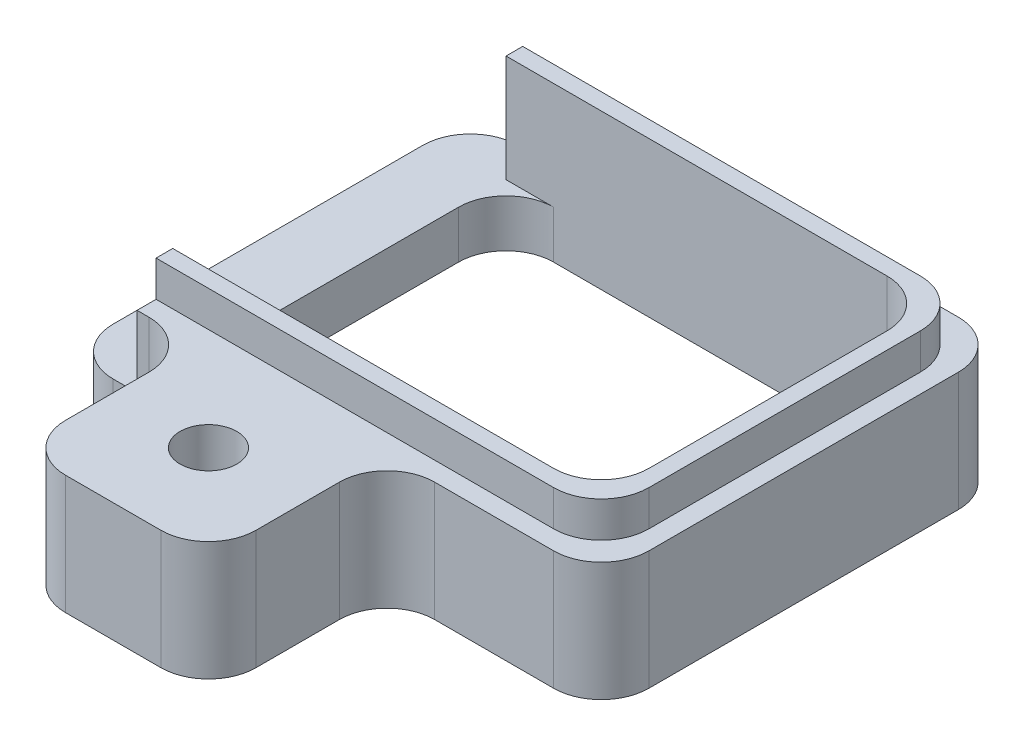
ISO-10303-21;
HEADER;
FILE_DESCRIPTION(('STEP AP214'),'2;1');
FILE_NAME('part.step','',(''),(''),'','','');
FILE_SCHEMA(('AUTOMOTIVE_DESIGN { 1 0 10303 214 1 1 1 1 }'));
ENDSEC;
DATA;
#1=APPLICATION_CONTEXT('core data for automotive mechanical design processes');
#2=APPLICATION_PROTOCOL_DEFINITION('international standard','automotive_design',2000,#1);
#3=PRODUCT_CONTEXT('',#1,'mechanical');
#4=PRODUCT('Part','Part','',(#3));
#5=PRODUCT_RELATED_PRODUCT_CATEGORY('part','',(#4));
#6=PRODUCT_DEFINITION_FORMATION('','',#4);
#7=PRODUCT_DEFINITION_CONTEXT('part definition',#1,'design');
#8=PRODUCT_DEFINITION('design','',#6,#7);
#9=PRODUCT_DEFINITION_SHAPE('','',#8);
#10=(LENGTH_UNIT() NAMED_UNIT(*) SI_UNIT(.MILLI.,.METRE.));
#11=(NAMED_UNIT(*) PLANE_ANGLE_UNIT() SI_UNIT($,.RADIAN.));
#12=(NAMED_UNIT(*) SI_UNIT($,.STERADIAN.) SOLID_ANGLE_UNIT());
#13=UNCERTAINTY_MEASURE_WITH_UNIT(LENGTH_MEASURE(1.E-05),#10,'distance_accuracy_value','');
#14=(GEOMETRIC_REPRESENTATION_CONTEXT(3) GLOBAL_UNCERTAINTY_ASSIGNED_CONTEXT((#13)) GLOBAL_UNIT_ASSIGNED_CONTEXT((#10,
#11,#12)) REPRESENTATION_CONTEXT('',''));
#15=CARTESIAN_POINT('',(0.,0.,0.));
#16=DIRECTION('',(0.,0.,1.));
#17=DIRECTION('',(1.,0.,0.));
#18=AXIS2_PLACEMENT_3D('',#15,#16,#17);
#19=CARTESIAN_POINT('',(5.62499999999999,2.5,-4.25));
#20=DIRECTION('',(0.,-1.,0.));
#21=DIRECTION('',(0.,0.,-1.));
#22=AXIS2_PLACEMENT_3D('',#19,#20,#21);
#23=PLANE('',#22);
#24=CARTESIAN_POINT('',(-0.875000000000002,2.5,6.));
#25=DIRECTION('',(0.,1.,0.));
#26=DIRECTION('',(0.,0.,1.));
#27=AXIS2_PLACEMENT_3D('',#24,#25,#26);
#28=CIRCLE('',#27,0.595629999999989);
#29=CARTESIAN_POINT('',(-0.875000000000002,2.5,6.59562999999999));
#30=VERTEX_POINT('',#29);
#31=EDGE_CURVE('E606',#30,#30,#28,.T.);
#32=ORIENTED_EDGE('',*,*,#31,.F.);
#33=EDGE_LOOP('',(#32));
#34=FACE_BOUND('',#33,.T.);
#35=DIRECTION('',(0.,0.,-1.));
#36=VECTOR('',#35,1.);
#37=CARTESIAN_POINT('',(-2.875,2.5,8.));
#38=LINE('',#37,#36);
#39=CARTESIAN_POINT('',(-2.875,2.5,7.));
#40=VERTEX_POINT('',#39);
#41=CARTESIAN_POINT('',(-2.875,2.5,5.25));
#42=VERTEX_POINT('',#41);
#43=EDGE_CURVE('E326',#40,#42,#38,.T.);
#44=ORIENTED_EDGE('',*,*,#43,.F.);
#45=CARTESIAN_POINT('',(-1.875,2.5,7.));
#46=DIRECTION('',(0.,-1.,0.));
#47=DIRECTION('',(0.,0.,-1.));
#48=AXIS2_PLACEMENT_3D('',#45,#46,#47);
#49=CIRCLE('',#48,1.);
#50=CARTESIAN_POINT('',(-1.875,2.5,8.));
#51=VERTEX_POINT('',#50);
#52=EDGE_CURVE('E420',#40,#51,#49,.F.);
#53=ORIENTED_EDGE('',*,*,#52,.T.);
#54=DIRECTION('',(-1.,0.,0.));
#55=VECTOR('',#54,1.);
#56=CARTESIAN_POINT('',(-2.875,2.5,8.));
#57=LINE('',#56,#55);
#58=CARTESIAN_POINT('',(0.124999999999998,2.5,8.));
#59=VERTEX_POINT('',#58);
#60=EDGE_CURVE('E393',#59,#51,#57,.T.);
#61=ORIENTED_EDGE('',*,*,#60,.F.);
#62=CARTESIAN_POINT('',(0.124999999999998,2.5,7.));
#63=DIRECTION('',(0.,-1.,0.));
#64=DIRECTION('',(0.,0.,-1.));
#65=AXIS2_PLACEMENT_3D('',#62,#63,#64);
#66=CIRCLE('',#65,1.);
#67=CARTESIAN_POINT('',(1.125,2.5,7.));
#68=VERTEX_POINT('',#67);
#69=EDGE_CURVE('E416',#59,#68,#66,.F.);
#70=ORIENTED_EDGE('',*,*,#69,.T.);
#71=DIRECTION('',(0.,0.,-1.));
#72=VECTOR('',#71,1.);
#73=CARTESIAN_POINT('',(1.125,2.5,8.));
#74=LINE('',#73,#72);
#75=CARTESIAN_POINT('',(1.125,2.5,5.25));
#76=VERTEX_POINT('',#75);
#77=EDGE_CURVE('E321',#68,#76,#74,.T.);
#78=ORIENTED_EDGE('',*,*,#77,.T.);
#79=CARTESIAN_POINT('',(2.125,2.5,5.25));
#80=DIRECTION('',(0.,-1.,0.));
#81=DIRECTION('',(0.,0.,-1.));
#82=AXIS2_PLACEMENT_3D('',#79,#80,#81);
#83=CIRCLE('',#82,1.);
#84=CARTESIAN_POINT('',(2.125,2.5,4.25));
#85=VERTEX_POINT('',#84);
#86=EDGE_CURVE('E466',#76,#85,#83,.T.);
#87=ORIENTED_EDGE('',*,*,#86,.T.);
#88=DIRECTION('',(1.,0.,0.));
#89=VECTOR('',#88,1.);
#90=CARTESIAN_POINT('',(-5.625,2.5,4.25));
#91=LINE('',#90,#89);
#92=CARTESIAN_POINT('',(4.62499999999999,2.5,4.25));
#93=VERTEX_POINT('',#92);
#94=EDGE_CURVE('E327',#85,#93,#91,.T.);
#95=ORIENTED_EDGE('',*,*,#94,.T.);
#96=CARTESIAN_POINT('',(4.625,2.5,3.25));
#97=DIRECTION('',(0.,-1.,0.));
#98=DIRECTION('',(0.,0.,-1.));
#99=AXIS2_PLACEMENT_3D('',#96,#97,#98);
#100=CIRCLE('',#99,1.);
#101=CARTESIAN_POINT('',(5.625,2.5,3.25));
#102=VERTEX_POINT('',#101);
#103=EDGE_CURVE('E408',#93,#102,#100,.F.);
#104=ORIENTED_EDGE('',*,*,#103,.T.);
#105=DIRECTION('',(0.,0.,-1.));
#106=VECTOR('',#105,1.);
#107=CARTESIAN_POINT('',(5.625,2.5,4.25));
#108=LINE('',#107,#106);
#109=CARTESIAN_POINT('',(5.625,2.5,-3.25));
#110=VERTEX_POINT('',#109);
#111=EDGE_CURVE('E352',#102,#110,#108,.T.);
#112=ORIENTED_EDGE('',*,*,#111,.T.);
#113=CARTESIAN_POINT('',(4.625,2.5,-3.25));
#114=DIRECTION('',(0.,-1.,0.));
#115=DIRECTION('',(0.,0.,-1.));
#116=AXIS2_PLACEMENT_3D('',#113,#114,#115);
#117=CIRCLE('',#116,1.);
#118=CARTESIAN_POINT('',(4.62499999999999,2.5,-4.25));
#119=VERTEX_POINT('',#118);
#120=EDGE_CURVE('E411',#110,#119,#117,.F.);
#121=ORIENTED_EDGE('',*,*,#120,.T.);
#122=DIRECTION('',(-1.,0.,0.));
#123=VECTOR('',#122,1.);
#124=CARTESIAN_POINT('',(-5.625,2.5,-4.25));
#125=LINE('',#124,#123);
#126=CARTESIAN_POINT('',(-4.125,2.5,-4.25));
#127=VERTEX_POINT('',#126);
#128=EDGE_CURVE('E369',#119,#127,#125,.T.);
#129=ORIENTED_EDGE('',*,*,#128,.T.);
#130=DIRECTION('',(0.,0.,-1.));
#131=VECTOR('',#130,1.);
#132=CARTESIAN_POINT('',(-4.125,2.5,-4.25));
#133=LINE('',#132,#131);
#134=CARTESIAN_POINT('',(-4.125,2.5,-3.85));
#135=VERTEX_POINT('',#134);
#136=EDGE_CURVE('E286',#135,#127,#133,.T.);
#137=ORIENTED_EDGE('',*,*,#136,.F.);
#138=DIRECTION('',(-1.,0.,0.));
#139=VECTOR('',#138,1.);
#140=CARTESIAN_POINT('',(5.225,2.5,-3.85));
#141=LINE('',#140,#139);
#142=CARTESIAN_POINT('',(4.225,2.5,-3.85));
#143=VERTEX_POINT('',#142);
#144=EDGE_CURVE('E309',#143,#135,#141,.T.);
#145=ORIENTED_EDGE('',*,*,#144,.F.);
#146=CARTESIAN_POINT('',(4.225,2.5,-2.85));
#147=DIRECTION('',(0.,-1.,0.));
#148=DIRECTION('',(0.,0.,-1.));
#149=AXIS2_PLACEMENT_3D('',#146,#147,#148);
#150=CIRCLE('',#149,1.);
#151=CARTESIAN_POINT('',(5.225,2.5,-2.85));
#152=VERTEX_POINT('',#151);
#153=EDGE_CURVE('E470',#143,#152,#150,.T.);
#154=ORIENTED_EDGE('',*,*,#153,.T.);
#155=DIRECTION('',(0.,0.,-1.));
#156=VECTOR('',#155,1.);
#157=CARTESIAN_POINT('',(5.225,2.5,3.85));
#158=LINE('',#157,#156);
#159=CARTESIAN_POINT('',(5.225,2.5,2.85));
#160=VERTEX_POINT('',#159);
#161=EDGE_CURVE('E306',#160,#152,#158,.T.);
#162=ORIENTED_EDGE('',*,*,#161,.F.);
#163=CARTESIAN_POINT('',(4.225,2.5,2.85));
#164=DIRECTION('',(0.,-1.,0.));
#165=DIRECTION('',(0.,0.,-1.));
#166=AXIS2_PLACEMENT_3D('',#163,#164,#165);
#167=CIRCLE('',#166,1.);
#168=CARTESIAN_POINT('',(4.225,2.5,3.85));
#169=VERTEX_POINT('',#168);
#170=EDGE_CURVE('E472',#160,#169,#167,.T.);
#171=ORIENTED_EDGE('',*,*,#170,.T.);
#172=DIRECTION('',(1.,0.,0.));
#173=VECTOR('',#172,1.);
#174=CARTESIAN_POINT('',(-4.125,2.5,3.85));
#175=LINE('',#174,#173);
#176=CARTESIAN_POINT('',(-4.125,2.5,3.85));
#177=VERTEX_POINT('',#176);
#178=EDGE_CURVE('E310',#177,#169,#175,.T.);
#179=ORIENTED_EDGE('',*,*,#178,.F.);
#180=CARTESIAN_POINT('',(-4.125,2.5,4.25));
#181=VERTEX_POINT('',#180);
#182=EDGE_CURVE('E386',#181,#177,#133,.T.);
#183=ORIENTED_EDGE('',*,*,#182,.F.);
#184=CARTESIAN_POINT('',(-3.875,2.5,4.25));
#185=VERTEX_POINT('',#184);
#186=EDGE_CURVE('E333',#181,#185,#91,.T.);
#187=ORIENTED_EDGE('',*,*,#186,.T.);
#188=CARTESIAN_POINT('',(-3.875,2.5,5.25));
#189=DIRECTION('',(0.,-1.,0.));
#190=DIRECTION('',(0.,0.,-1.));
#191=AXIS2_PLACEMENT_3D('',#188,#189,#190);
#192=CIRCLE('',#191,1.);
#193=EDGE_CURVE('E464',#185,#42,#192,.T.);
#194=ORIENTED_EDGE('',*,*,#193,.T.);
#195=EDGE_LOOP('',(#44,#53,#61,#70,#78,#87,#95,#104,#112,#121,#129,#137,#145,#154,#162,#171,
#179,#183,#187,#194));
#196=FACE_BOUND('',#195,.T.);
#197=ADVANCED_FACE('F42',(#34,#196),#23,.F.);
#198=CARTESIAN_POINT('',(-5.625,2.5,4.25));
#199=DIRECTION('',(0.,0.,-1.));
#200=DIRECTION('',(-1.,0.,0.));
#201=AXIS2_PLACEMENT_3D('',#198,#199,#200);
#202=PLANE('',#201);
#203=DIRECTION('',(1.,0.,0.));
#204=VECTOR('',#203,1.);
#205=CARTESIAN_POINT('',(-5.625,1.,4.25));
#206=LINE('',#205,#204);
#207=CARTESIAN_POINT('',(-4.625,1.,4.25));
#208=VERTEX_POINT('',#207);
#209=CARTESIAN_POINT('',(-4.125,1.,4.25));
#210=VERTEX_POINT('',#209);
#211=EDGE_CURVE('E513',#208,#210,#206,.T.);
#212=ORIENTED_EDGE('',*,*,#211,.F.);
#213=DIRECTION('',(0.,-1.,0.));
#214=VECTOR('',#213,1.);
#215=CARTESIAN_POINT('',(-4.625,2.5,4.25));
#216=LINE('',#215,#214);
#217=CARTESIAN_POINT('',(-4.625,0.,4.25));
#218=VERTEX_POINT('',#217);
#219=EDGE_CURVE('E394',#208,#218,#216,.T.);
#220=ORIENTED_EDGE('',*,*,#219,.T.);
#221=DIRECTION('',(1.,0.,0.));
#222=VECTOR('',#221,1.);
#223=CARTESIAN_POINT('',(-5.625,0.,4.25));
#224=LINE('',#223,#222);
#225=CARTESIAN_POINT('',(-3.875,0.,4.25));
#226=VERTEX_POINT('',#225);
#227=EDGE_CURVE('E349',#218,#226,#224,.T.);
#228=ORIENTED_EDGE('',*,*,#227,.T.);
#229=DIRECTION('',(0.,-1.,0.));
#230=VECTOR('',#229,1.);
#231=CARTESIAN_POINT('',(-3.875,2.5,4.25));
#232=LINE('',#231,#230);
#233=EDGE_CURVE('E546',#226,#185,#232,.F.);
#234=ORIENTED_EDGE('',*,*,#233,.T.);
#235=ORIENTED_EDGE('',*,*,#186,.F.);
#236=DIRECTION('',(0.,1.,0.));
#237=VECTOR('',#236,1.);
#238=CARTESIAN_POINT('',(-4.125,1.,4.25));
#239=LINE('',#238,#237);
#240=EDGE_CURVE('E374',#210,#181,#239,.T.);
#241=ORIENTED_EDGE('',*,*,#240,.F.);
#242=EDGE_LOOP('',(#212,#220,#228,#234,#235,#241));
#243=FACE_BOUND('',#242,.T.);
#244=ADVANCED_FACE('F555',(#243),#202,.F.);
#245=ORIENTED_EDGE('',*,*,#94,.F.);
#246=DIRECTION('',(0.,1.,0.));
#247=VECTOR('',#246,1.);
#248=CARTESIAN_POINT('',(2.125,0.,4.25));
#249=LINE('',#248,#247);
#250=CARTESIAN_POINT('',(2.125,0.,4.25));
#251=VERTEX_POINT('',#250);
#252=EDGE_CURVE('E429',#85,#251,#249,.F.);
#253=ORIENTED_EDGE('',*,*,#252,.T.);
#254=CARTESIAN_POINT('',(4.62499999999999,0.,4.25));
#255=VERTEX_POINT('',#254);
#256=EDGE_CURVE('E344',#251,#255,#224,.T.);
#257=ORIENTED_EDGE('',*,*,#256,.T.);
#258=DIRECTION('',(0.,-1.,0.));
#259=VECTOR('',#258,1.);
#260=CARTESIAN_POINT('',(4.625,2.5,4.25));
#261=LINE('',#260,#259);
#262=EDGE_CURVE('E427',#255,#93,#261,.F.);
#263=ORIENTED_EDGE('',*,*,#262,.T.);
#264=EDGE_LOOP('',(#245,#253,#257,#263));
#265=FACE_BOUND('',#264,.T.);
#266=ADVANCED_FACE('F647',(#265),#202,.F.);
#267=CARTESIAN_POINT('',(-4.125,1.,-4.25));
#268=DIRECTION('',(1.,0.,0.));
#269=DIRECTION('',(0.,0.,-1.));
#270=AXIS2_PLACEMENT_3D('',#267,#268,#269);
#271=PLANE('',#270);
#272=ORIENTED_EDGE('',*,*,#182,.T.);
#273=DIRECTION('',(0.,-1.,0.));
#274=VECTOR('',#273,1.);
#275=CARTESIAN_POINT('',(-4.125,3.25,3.85));
#276=LINE('',#275,#274);
#277=CARTESIAN_POINT('',(-4.125,3.25,3.85));
#278=VERTEX_POINT('',#277);
#279=EDGE_CURVE('E292',#278,#177,#276,.T.);
#280=ORIENTED_EDGE('',*,*,#279,.F.);
#281=DIRECTION('',(0.,0.,1.));
#282=VECTOR('',#281,1.);
#283=CARTESIAN_POINT('',(-4.125,3.25,3.5));
#284=LINE('',#283,#282);
#285=CARTESIAN_POINT('',(-4.125,3.25,3.5));
#286=VERTEX_POINT('',#285);
#287=EDGE_CURVE('E268',#286,#278,#284,.T.);
#288=ORIENTED_EDGE('',*,*,#287,.F.);
#289=DIRECTION('',(0.,1.,0.));
#290=VECTOR('',#289,1.);
#291=CARTESIAN_POINT('',(-4.125,0.,3.5));
#292=LINE('',#291,#290);
#293=CARTESIAN_POINT('',(-4.125,1.,3.5));
#294=VERTEX_POINT('',#293);
#295=EDGE_CURVE('E277',#294,#286,#292,.T.);
#296=ORIENTED_EDGE('',*,*,#295,.F.);
#297=DIRECTION('',(0.,0.,-1.));
#298=VECTOR('',#297,1.);
#299=CARTESIAN_POINT('',(-4.125,1.,-4.25));
#300=LINE('',#299,#298);
#301=EDGE_CURVE('E515',#210,#294,#300,.T.);
#302=ORIENTED_EDGE('',*,*,#301,.F.);
#303=ORIENTED_EDGE('',*,*,#240,.T.);
#304=EDGE_LOOP('',(#272,#280,#288,#296,#302,#303));
#305=FACE_BOUND('',#304,.T.);
#306=ADVANCED_FACE('F290',(#305),#271,.F.);
#307=CARTESIAN_POINT('',(-5.625,2.5,4.25));
#308=DIRECTION('',(1.,0.,0.));
#309=DIRECTION('',(0.,0.,-1.));
#310=AXIS2_PLACEMENT_3D('',#307,#308,#309);
#311=PLANE('',#310);
#312=DIRECTION('',(0.,0.,1.));
#313=VECTOR('',#312,1.);
#314=CARTESIAN_POINT('',(-5.625,1.,-4.25));
#315=LINE('',#314,#313);
#316=CARTESIAN_POINT('',(-5.625,1.,-3.25));
#317=VERTEX_POINT('',#316);
#318=CARTESIAN_POINT('',(-5.625,1.,3.25));
#319=VERTEX_POINT('',#318);
#320=EDGE_CURVE('E387',#317,#319,#315,.T.);
#321=ORIENTED_EDGE('',*,*,#320,.F.);
#322=DIRECTION('',(0.,-1.,0.));
#323=VECTOR('',#322,1.);
#324=CARTESIAN_POINT('',(-5.625,2.5,-3.25));
#325=LINE('',#324,#323);
#326=CARTESIAN_POINT('',(-5.625,0.,-3.25));
#327=VERTEX_POINT('',#326);
#328=EDGE_CURVE('E582',#317,#327,#325,.T.);
#329=ORIENTED_EDGE('',*,*,#328,.T.);
#330=DIRECTION('',(0.,0.,1.));
#331=VECTOR('',#330,1.);
#332=CARTESIAN_POINT('',(-5.625,0.,4.25));
#333=LINE('',#332,#331);
#334=CARTESIAN_POINT('',(-5.625,0.,3.25));
#335=VERTEX_POINT('',#334);
#336=EDGE_CURVE('E357',#327,#335,#333,.T.);
#337=ORIENTED_EDGE('',*,*,#336,.T.);
#338=DIRECTION('',(0.,-1.,0.));
#339=VECTOR('',#338,1.);
#340=CARTESIAN_POINT('',(-5.625,2.5,3.25));
#341=LINE('',#340,#339);
#342=EDGE_CURVE('E587',#335,#319,#341,.F.);
#343=ORIENTED_EDGE('',*,*,#342,.T.);
#344=EDGE_LOOP('',(#321,#329,#337,#343));
#345=FACE_BOUND('',#344,.T.);
#346=ADVANCED_FACE('F585',(#345),#311,.F.);
#347=CARTESIAN_POINT('',(5.625,2.5,4.25));
#348=DIRECTION('',(-1.,0.,0.));
#349=DIRECTION('',(0.,0.,1.));
#350=AXIS2_PLACEMENT_3D('',#347,#348,#349);
#351=PLANE('',#350);
#352=DIRECTION('',(0.,0.,-1.));
#353=VECTOR('',#352,1.);
#354=CARTESIAN_POINT('',(5.625,0.,4.25));
#355=LINE('',#354,#353);
#356=CARTESIAN_POINT('',(5.625,0.,3.25));
#357=VERTEX_POINT('',#356);
#358=CARTESIAN_POINT('',(5.625,0.,-3.25));
#359=VERTEX_POINT('',#358);
#360=EDGE_CURVE('E364',#357,#359,#355,.T.);
#361=ORIENTED_EDGE('',*,*,#360,.T.);
#362=DIRECTION('',(0.,-1.,0.));
#363=VECTOR('',#362,1.);
#364=CARTESIAN_POINT('',(5.625,2.5,-3.25));
#365=LINE('',#364,#363);
#366=EDGE_CURVE('E434',#359,#110,#365,.F.);
#367=ORIENTED_EDGE('',*,*,#366,.T.);
#368=ORIENTED_EDGE('',*,*,#111,.F.);
#369=DIRECTION('',(0.,-1.,0.));
#370=VECTOR('',#369,1.);
#371=CARTESIAN_POINT('',(5.625,2.5,3.25));
#372=LINE('',#371,#370);
#373=EDGE_CURVE('E431',#102,#357,#372,.T.);
#374=ORIENTED_EDGE('',*,*,#373,.T.);
#375=EDGE_LOOP('',(#361,#367,#368,#374));
#376=FACE_BOUND('',#375,.T.);
#377=ADVANCED_FACE('F657',(#376),#351,.F.);
#378=CARTESIAN_POINT('',(-5.625,2.5,-4.25));
#379=DIRECTION('',(0.,0.,1.));
#380=DIRECTION('',(1.,0.,0.));
#381=AXIS2_PLACEMENT_3D('',#378,#379,#380);
#382=PLANE('',#381);
#383=DIRECTION('',(-1.,0.,0.));
#384=VECTOR('',#383,1.);
#385=CARTESIAN_POINT('',(-5.625,0.,-4.25));
#386=LINE('',#385,#384);
#387=CARTESIAN_POINT('',(4.62499999999999,0.,-4.25));
#388=VERTEX_POINT('',#387);
#389=CARTESIAN_POINT('',(-4.625,0.,-4.25));
#390=VERTEX_POINT('',#389);
#391=EDGE_CURVE('E361',#388,#390,#386,.T.);
#392=ORIENTED_EDGE('',*,*,#391,.T.);
#393=DIRECTION('',(0.,-1.,0.));
#394=VECTOR('',#393,1.);
#395=CARTESIAN_POINT('',(-4.625,2.5,-4.25));
#396=LINE('',#395,#394);
#397=CARTESIAN_POINT('',(-4.625,1.,-4.25));
#398=VERTEX_POINT('',#397);
#399=EDGE_CURVE('E533',#390,#398,#396,.F.);
#400=ORIENTED_EDGE('',*,*,#399,.T.);
#401=DIRECTION('',(-1.,0.,0.));
#402=VECTOR('',#401,1.);
#403=CARTESIAN_POINT('',(-5.625,1.,-4.25));
#404=LINE('',#403,#402);
#405=CARTESIAN_POINT('',(-4.125,1.,-4.25));
#406=VERTEX_POINT('',#405);
#407=EDGE_CURVE('E376',#406,#398,#404,.T.);
#408=ORIENTED_EDGE('',*,*,#407,.F.);
#409=DIRECTION('',(0.,1.,0.));
#410=VECTOR('',#409,1.);
#411=CARTESIAN_POINT('',(-4.125,1.,-4.25));
#412=LINE('',#411,#410);
#413=EDGE_CURVE('E366',#406,#127,#412,.T.);
#414=ORIENTED_EDGE('',*,*,#413,.T.);
#415=ORIENTED_EDGE('',*,*,#128,.F.);
#416=DIRECTION('',(0.,-1.,0.));
#417=VECTOR('',#416,1.);
#418=CARTESIAN_POINT('',(4.625,2.5,-4.25));
#419=LINE('',#418,#417);
#420=EDGE_CURVE('E538',#119,#388,#419,.T.);
#421=ORIENTED_EDGE('',*,*,#420,.T.);
#422=EDGE_LOOP('',(#392,#400,#408,#414,#415,#421));
#423=FACE_BOUND('',#422,.T.);
#424=ADVANCED_FACE('F531',(#423),#382,.F.);
#425=CARTESIAN_POINT('',(5.62499999999999,0.,-4.25));
#426=DIRECTION('',(0.,-1.,0.));
#427=DIRECTION('',(0.,0.,-1.));
#428=AXIS2_PLACEMENT_3D('',#425,#426,#427);
#429=PLANE('',#428);
#430=CARTESIAN_POINT('',(-0.875000000000002,0.,6.));
#431=DIRECTION('',(0.,-1.,0.));
#432=DIRECTION('',(0.,0.,-1.));
#433=AXIS2_PLACEMENT_3D('',#430,#431,#432);
#434=CIRCLE('',#433,0.595629999999984);
#435=CARTESIAN_POINT('',(-0.875000000000002,0.,5.40437000000002));
#436=VERTEX_POINT('',#435);
#437=EDGE_CURVE('E603',#436,#436,#434,.T.);
#438=ORIENTED_EDGE('',*,*,#437,.F.);
#439=EDGE_LOOP('',(#438));
#440=FACE_BOUND('',#439,.T.);
#441=DIRECTION('',(1.,0.,0.));
#442=VECTOR('',#441,1.);
#443=CARTESIAN_POINT('',(4.875,0.,3.5));
#444=LINE('',#443,#442);
#445=CARTESIAN_POINT('',(-3.125,0.,3.5));
#446=VERTEX_POINT('',#445);
#447=CARTESIAN_POINT('',(3.875,0.,3.5));
#448=VERTEX_POINT('',#447);
#449=EDGE_CURVE('E505',#446,#448,#444,.T.);
#450=ORIENTED_EDGE('',*,*,#449,.T.);
#451=CARTESIAN_POINT('',(3.875,0.,2.5));
#452=DIRECTION('',(0.,-1.,0.));
#453=DIRECTION('',(0.,0.,-1.));
#454=AXIS2_PLACEMENT_3D('',#451,#452,#453);
#455=CIRCLE('',#454,1.);
#456=CARTESIAN_POINT('',(4.875,0.,2.5));
#457=VERTEX_POINT('',#456);
#458=EDGE_CURVE('E475',#448,#457,#455,.F.);
#459=ORIENTED_EDGE('',*,*,#458,.T.);
#460=DIRECTION('',(0.,0.,-1.));
#461=VECTOR('',#460,1.);
#462=CARTESIAN_POINT('',(4.875,0.,-3.5));
#463=LINE('',#462,#461);
#464=CARTESIAN_POINT('',(4.875,0.,-2.5));
#465=VERTEX_POINT('',#464);
#466=EDGE_CURVE('E348',#457,#465,#463,.T.);
#467=ORIENTED_EDGE('',*,*,#466,.T.);
#468=CARTESIAN_POINT('',(3.875,0.,-2.5));
#469=DIRECTION('',(0.,-1.,0.));
#470=DIRECTION('',(0.,0.,-1.));
#471=AXIS2_PLACEMENT_3D('',#468,#469,#470);
#472=CIRCLE('',#471,1.);
#473=CARTESIAN_POINT('',(3.875,0.,-3.5));
#474=VERTEX_POINT('',#473);
#475=EDGE_CURVE('E13',#465,#474,#472,.F.);
#476=ORIENTED_EDGE('',*,*,#475,.T.);
#477=DIRECTION('',(-1.,0.,0.));
#478=VECTOR('',#477,1.);
#479=CARTESIAN_POINT('',(4.875,0.,-3.5));
#480=LINE('',#479,#478);
#481=CARTESIAN_POINT('',(-3.125,0.,-3.5));
#482=VERTEX_POINT('',#481);
#483=EDGE_CURVE('E496',#474,#482,#480,.T.);
#484=ORIENTED_EDGE('',*,*,#483,.T.);
#485=CARTESIAN_POINT('',(-3.125,0.,-2.5));
#486=DIRECTION('',(0.,-1.,0.));
#487=DIRECTION('',(0.,0.,-1.));
#488=AXIS2_PLACEMENT_3D('',#485,#486,#487);
#489=CIRCLE('',#488,1.);
#490=CARTESIAN_POINT('',(-4.125,0.,-2.5));
#491=VERTEX_POINT('',#490);
#492=EDGE_CURVE('E460',#482,#491,#489,.F.);
#493=ORIENTED_EDGE('',*,*,#492,.T.);
#494=DIRECTION('',(0.,0.,1.));
#495=VECTOR('',#494,1.);
#496=CARTESIAN_POINT('',(-4.125,0.,-3.5));
#497=LINE('',#496,#495);
#498=CARTESIAN_POINT('',(-4.125,0.,2.5));
#499=VERTEX_POINT('',#498);
#500=EDGE_CURVE('E502',#491,#499,#497,.T.);
#501=ORIENTED_EDGE('',*,*,#500,.T.);
#502=CARTESIAN_POINT('',(-3.125,0.,2.5));
#503=DIRECTION('',(0.,-1.,0.));
#504=DIRECTION('',(0.,0.,-1.));
#505=AXIS2_PLACEMENT_3D('',#502,#503,#504);
#506=CIRCLE('',#505,1.);
#507=EDGE_CURVE('E456',#499,#446,#506,.F.);
#508=ORIENTED_EDGE('',*,*,#507,.T.);
#509=EDGE_LOOP('',(#450,#459,#467,#476,#484,#493,#501,#508));
#510=FACE_BOUND('',#509,.T.);
#511=ORIENTED_EDGE('',*,*,#336,.F.);
#512=CARTESIAN_POINT('',(-4.625,0.,-3.25));
#513=DIRECTION('',(0.,-1.,0.));
#514=DIRECTION('',(0.,0.,-1.));
#515=AXIS2_PLACEMENT_3D('',#512,#513,#514);
#516=CIRCLE('',#515,1.);
#517=EDGE_CURVE('E542',#327,#390,#516,.T.);
#518=ORIENTED_EDGE('',*,*,#517,.T.);
#519=ORIENTED_EDGE('',*,*,#391,.F.);
#520=CARTESIAN_POINT('',(4.625,0.,-3.25));
#521=DIRECTION('',(0.,-1.,0.));
#522=DIRECTION('',(0.,0.,-1.));
#523=AXIS2_PLACEMENT_3D('',#520,#521,#522);
#524=CIRCLE('',#523,1.);
#525=EDGE_CURVE('E577',#388,#359,#524,.T.);
#526=ORIENTED_EDGE('',*,*,#525,.T.);
#527=ORIENTED_EDGE('',*,*,#360,.F.);
#528=CARTESIAN_POINT('',(4.625,0.,3.25));
#529=DIRECTION('',(0.,-1.,0.));
#530=DIRECTION('',(0.,0.,-1.));
#531=AXIS2_PLACEMENT_3D('',#528,#529,#530);
#532=CIRCLE('',#531,1.);
#533=EDGE_CURVE('E353',#357,#255,#532,.T.);
#534=ORIENTED_EDGE('',*,*,#533,.T.);
#535=ORIENTED_EDGE('',*,*,#256,.F.);
#536=CARTESIAN_POINT('',(2.125,0.,5.25));
#537=DIRECTION('',(0.,-1.,0.));
#538=DIRECTION('',(0.,0.,-1.));
#539=AXIS2_PLACEMENT_3D('',#536,#537,#538);
#540=CIRCLE('',#539,1.);
#541=CARTESIAN_POINT('',(1.125,0.,5.25));
#542=VERTEX_POINT('',#541);
#543=EDGE_CURVE('E468',#251,#542,#540,.F.);
#544=ORIENTED_EDGE('',*,*,#543,.T.);
#545=DIRECTION('',(0.,0.,-1.));
#546=VECTOR('',#545,1.);
#547=CARTESIAN_POINT('',(1.125,0.,8.));
#548=LINE('',#547,#546);
#549=CARTESIAN_POINT('',(1.125,0.,7.));
#550=VERTEX_POINT('',#549);
#551=EDGE_CURVE('E325',#550,#542,#548,.T.);
#552=ORIENTED_EDGE('',*,*,#551,.F.);
#553=CARTESIAN_POINT('',(0.124999999999998,0.,7.));
#554=DIRECTION('',(0.,-1.,0.));
#555=DIRECTION('',(0.,0.,-1.));
#556=AXIS2_PLACEMENT_3D('',#553,#554,#555);
#557=CIRCLE('',#556,1.);
#558=CARTESIAN_POINT('',(0.124999999999998,0.,8.));
#559=VERTEX_POINT('',#558);
#560=EDGE_CURVE('E574',#550,#559,#557,.T.);
#561=ORIENTED_EDGE('',*,*,#560,.T.);
#562=DIRECTION('',(1.,0.,0.));
#563=VECTOR('',#562,1.);
#564=CARTESIAN_POINT('',(-2.875,0.,8.));
#565=LINE('',#564,#563);
#566=CARTESIAN_POINT('',(-1.875,0.,8.));
#567=VERTEX_POINT('',#566);
#568=EDGE_CURVE('E313',#567,#559,#565,.T.);
#569=ORIENTED_EDGE('',*,*,#568,.F.);
#570=CARTESIAN_POINT('',(-1.875,0.,7.));
#571=DIRECTION('',(0.,-1.,0.));
#572=DIRECTION('',(0.,0.,-1.));
#573=AXIS2_PLACEMENT_3D('',#570,#571,#572);
#574=CIRCLE('',#573,1.);
#575=CARTESIAN_POINT('',(-2.875,0.,7.));
#576=VERTEX_POINT('',#575);
#577=EDGE_CURVE('E573',#567,#576,#574,.T.);
#578=ORIENTED_EDGE('',*,*,#577,.T.);
#579=DIRECTION('',(0.,0.,-1.));
#580=VECTOR('',#579,1.);
#581=CARTESIAN_POINT('',(-2.875,0.,8.));
#582=LINE('',#581,#580);
#583=CARTESIAN_POINT('',(-2.875,0.,5.25));
#584=VERTEX_POINT('',#583);
#585=EDGE_CURVE('E343',#576,#584,#582,.T.);
#586=ORIENTED_EDGE('',*,*,#585,.T.);
#587=CARTESIAN_POINT('',(-3.875,0.,5.25));
#588=DIRECTION('',(0.,-1.,0.));
#589=DIRECTION('',(0.,0.,-1.));
#590=AXIS2_PLACEMENT_3D('',#587,#588,#589);
#591=CIRCLE('',#590,1.);
#592=EDGE_CURVE('E462',#584,#226,#591,.F.);
#593=ORIENTED_EDGE('',*,*,#592,.T.);
#594=ORIENTED_EDGE('',*,*,#227,.F.);
#595=CARTESIAN_POINT('',(-4.625,0.,3.25));
#596=DIRECTION('',(0.,-1.,0.));
#597=DIRECTION('',(0.,0.,-1.));
#598=AXIS2_PLACEMENT_3D('',#595,#596,#597);
#599=CIRCLE('',#598,1.);
#600=EDGE_CURVE('E560',#218,#335,#599,.T.);
#601=ORIENTED_EDGE('',*,*,#600,.T.);
#602=EDGE_LOOP('',(#511,#518,#519,#526,#527,#534,#535,#544,#552,#561,#569,#578,#586,#593,#594,#601));
#603=FACE_BOUND('',#602,.T.);
#604=ADVANCED_FACE('F494',(#440,#510,#603),#429,.T.);
#605=CARTESIAN_POINT('',(-4.125,1.,-3.5));
#606=VERTEX_POINT('',#605);
#607=EDGE_CURVE('E514',#606,#406,#300,.T.);
#608=ORIENTED_EDGE('',*,*,#607,.F.);
#609=DIRECTION('',(0.,1.,0.));
#610=VECTOR('',#609,1.);
#611=CARTESIAN_POINT('',(-4.125,0.,-3.5));
#612=LINE('',#611,#610);
#613=CARTESIAN_POINT('',(-4.125,3.25,-3.5));
#614=VERTEX_POINT('',#613);
#615=EDGE_CURVE('E287',#606,#614,#612,.T.);
#616=ORIENTED_EDGE('',*,*,#615,.T.);
#617=DIRECTION('',(0.,0.,1.));
#618=VECTOR('',#617,1.);
#619=CARTESIAN_POINT('',(-4.125,3.25,-3.85));
#620=LINE('',#619,#618);
#621=CARTESIAN_POINT('',(-4.125,3.25,-3.85));
#622=VERTEX_POINT('',#621);
#623=EDGE_CURVE('E302',#622,#614,#620,.T.);
#624=ORIENTED_EDGE('',*,*,#623,.F.);
#625=DIRECTION('',(0.,-1.,0.));
#626=VECTOR('',#625,1.);
#627=CARTESIAN_POINT('',(-4.125,3.25,-3.85));
#628=LINE('',#627,#626);
#629=EDGE_CURVE('E305',#622,#135,#628,.T.);
#630=ORIENTED_EDGE('',*,*,#629,.T.);
#631=ORIENTED_EDGE('',*,*,#136,.T.);
#632=ORIENTED_EDGE('',*,*,#413,.F.);
#633=EDGE_LOOP('',(#608,#616,#624,#630,#631,#632));
#634=FACE_BOUND('',#633,.T.);
#635=ADVANCED_FACE('F526',(#634),#271,.F.);
#636=CARTESIAN_POINT('',(-5.625,1.,4.25));
#637=DIRECTION('',(0.,1.,0.));
#638=DIRECTION('',(0.,0.,1.));
#639=AXIS2_PLACEMENT_3D('',#636,#637,#638);
#640=PLANE('',#639);
#641=ORIENTED_EDGE('',*,*,#407,.T.);
#642=CARTESIAN_POINT('',(-4.625,1.,-3.25));
#643=DIRECTION('',(0.,1.,0.));
#644=DIRECTION('',(0.,0.,1.));
#645=AXIS2_PLACEMENT_3D('',#642,#643,#644);
#646=CIRCLE('',#645,1.);
#647=EDGE_CURVE('E540',#398,#317,#646,.T.);
#648=ORIENTED_EDGE('',*,*,#647,.T.);
#649=ORIENTED_EDGE('',*,*,#320,.T.);
#650=CARTESIAN_POINT('',(-4.625,1.,3.25));
#651=DIRECTION('',(0.,1.,0.));
#652=DIRECTION('',(0.,0.,1.));
#653=AXIS2_PLACEMENT_3D('',#650,#651,#652);
#654=CIRCLE('',#653,1.);
#655=EDGE_CURVE('E537',#319,#208,#654,.T.);
#656=ORIENTED_EDGE('',*,*,#655,.T.);
#657=ORIENTED_EDGE('',*,*,#211,.T.);
#658=ORIENTED_EDGE('',*,*,#301,.T.);
#659=DIRECTION('',(-1.,0.,0.));
#660=VECTOR('',#659,1.);
#661=CARTESIAN_POINT('',(4.875,1.,3.5));
#662=LINE('',#661,#660);
#663=CARTESIAN_POINT('',(-3.125,1.,3.5));
#664=VERTEX_POINT('',#663);
#665=EDGE_CURVE('E282',#664,#294,#662,.T.);
#666=ORIENTED_EDGE('',*,*,#665,.F.);
#667=CARTESIAN_POINT('',(-3.125,1.,2.5));
#668=DIRECTION('',(0.,1.,0.));
#669=DIRECTION('',(0.,0.,1.));
#670=AXIS2_PLACEMENT_3D('',#667,#668,#669);
#671=CIRCLE('',#670,1.);
#672=CARTESIAN_POINT('',(-4.125,1.,2.5));
#673=VERTEX_POINT('',#672);
#674=EDGE_CURVE('E454',#664,#673,#671,.F.);
#675=ORIENTED_EDGE('',*,*,#674,.T.);
#676=CARTESIAN_POINT('',(-4.125,1.,-2.5));
#677=VERTEX_POINT('',#676);
#678=EDGE_CURVE('E516',#673,#677,#300,.T.);
#679=ORIENTED_EDGE('',*,*,#678,.T.);
#680=CARTESIAN_POINT('',(-3.125,1.,-2.5));
#681=DIRECTION('',(0.,1.,0.));
#682=DIRECTION('',(0.,0.,1.));
#683=AXIS2_PLACEMENT_3D('',#680,#681,#682);
#684=CIRCLE('',#683,1.);
#685=CARTESIAN_POINT('',(-3.125,1.,-3.5));
#686=VERTEX_POINT('',#685);
#687=EDGE_CURVE('E458',#677,#686,#684,.F.);
#688=ORIENTED_EDGE('',*,*,#687,.T.);
#689=DIRECTION('',(1.,0.,0.));
#690=VECTOR('',#689,1.);
#691=CARTESIAN_POINT('',(4.875,1.,-3.5));
#692=LINE('',#691,#690);
#693=EDGE_CURVE('E57',#606,#686,#692,.T.);
#694=ORIENTED_EDGE('',*,*,#693,.F.);
#695=ORIENTED_EDGE('',*,*,#607,.T.);
#696=EDGE_LOOP('',(#641,#648,#649,#656,#657,#658,#666,#675,#679,#688,#694,#695));
#697=FACE_BOUND('',#696,.T.);
#698=ADVANCED_FACE('F521',(#697),#640,.T.);
#699=CARTESIAN_POINT('',(4.875,0.,-3.5));
#700=DIRECTION('',(1.,0.,0.));
#701=DIRECTION('',(0.,0.,-1.));
#702=AXIS2_PLACEMENT_3D('',#699,#700,#701);
#703=PLANE('',#702);
#704=ORIENTED_EDGE('',*,*,#466,.F.);
#705=DIRECTION('',(0.,1.,0.));
#706=VECTOR('',#705,1.);
#707=CARTESIAN_POINT('',(4.875,3.25,2.5));
#708=LINE('',#707,#706);
#709=CARTESIAN_POINT('',(4.875,3.25,2.5));
#710=VERTEX_POINT('',#709);
#711=EDGE_CURVE('E451',#457,#710,#708,.T.);
#712=ORIENTED_EDGE('',*,*,#711,.T.);
#713=DIRECTION('',(0.,0.,1.));
#714=VECTOR('',#713,1.);
#715=CARTESIAN_POINT('',(4.875,3.25,-3.5));
#716=LINE('',#715,#714);
#717=CARTESIAN_POINT('',(4.875,3.25,-2.5));
#718=VERTEX_POINT('',#717);
#719=EDGE_CURVE('E274',#718,#710,#716,.T.);
#720=ORIENTED_EDGE('',*,*,#719,.F.);
#721=DIRECTION('',(0.,1.,0.));
#722=VECTOR('',#721,1.);
#723=CARTESIAN_POINT('',(4.875,0.,-2.5));
#724=LINE('',#723,#722);
#725=EDGE_CURVE('E449',#718,#465,#724,.F.);
#726=ORIENTED_EDGE('',*,*,#725,.T.);
#727=EDGE_LOOP('',(#704,#712,#720,#726));
#728=FACE_BOUND('',#727,.T.);
#729=ADVANCED_FACE('F485',(#728),#703,.F.);
#730=CARTESIAN_POINT('',(4.875,0.,3.5));
#731=DIRECTION('',(0.,0.,1.));
#732=DIRECTION('',(1.,0.,0.));
#733=AXIS2_PLACEMENT_3D('',#730,#731,#732);
#734=PLANE('',#733);
#735=ORIENTED_EDGE('',*,*,#449,.F.);
#736=DIRECTION('',(0.,1.,0.));
#737=VECTOR('',#736,1.);
#738=CARTESIAN_POINT('',(-3.125,1.,3.5));
#739=LINE('',#738,#737);
#740=EDGE_CURVE('E598',#446,#664,#739,.T.);
#741=ORIENTED_EDGE('',*,*,#740,.T.);
#742=ORIENTED_EDGE('',*,*,#665,.T.);
#743=ORIENTED_EDGE('',*,*,#295,.T.);
#744=DIRECTION('',(-1.,0.,0.));
#745=VECTOR('',#744,1.);
#746=CARTESIAN_POINT('',(4.875,3.25,3.5));
#747=LINE('',#746,#745);
#748=CARTESIAN_POINT('',(3.875,3.25,3.5));
#749=VERTEX_POINT('',#748);
#750=EDGE_CURVE('E263',#749,#286,#747,.T.);
#751=ORIENTED_EDGE('',*,*,#750,.F.);
#752=DIRECTION('',(0.,1.,0.));
#753=VECTOR('',#752,1.);
#754=CARTESIAN_POINT('',(3.875,0.,3.5));
#755=LINE('',#754,#753);
#756=EDGE_CURVE('E601',#749,#448,#755,.F.);
#757=ORIENTED_EDGE('',*,*,#756,.T.);
#758=EDGE_LOOP('',(#735,#741,#742,#743,#751,#757));
#759=FACE_BOUND('',#758,.T.);
#760=ADVANCED_FACE('F279',(#759),#734,.F.);
#761=CARTESIAN_POINT('',(-4.125,0.,-3.5));
#762=DIRECTION('',(-1.,0.,0.));
#763=DIRECTION('',(0.,0.,1.));
#764=AXIS2_PLACEMENT_3D('',#761,#762,#763);
#765=PLANE('',#764);
#766=ORIENTED_EDGE('',*,*,#678,.F.);
#767=DIRECTION('',(0.,1.,0.));
#768=VECTOR('',#767,1.);
#769=CARTESIAN_POINT('',(-4.125,0.,2.5));
#770=LINE('',#769,#768);
#771=EDGE_CURVE('E593',#673,#499,#770,.F.);
#772=ORIENTED_EDGE('',*,*,#771,.T.);
#773=ORIENTED_EDGE('',*,*,#500,.F.);
#774=DIRECTION('',(0.,1.,0.));
#775=VECTOR('',#774,1.);
#776=CARTESIAN_POINT('',(-4.125,1.,-2.5));
#777=LINE('',#776,#775);
#778=EDGE_CURVE('E595',#491,#677,#777,.T.);
#779=ORIENTED_EDGE('',*,*,#778,.T.);
#780=EDGE_LOOP('',(#766,#772,#773,#779));
#781=FACE_BOUND('',#780,.T.);
#782=ADVANCED_FACE('F711',(#781),#765,.F.);
#783=CARTESIAN_POINT('',(4.875,0.,-3.5));
#784=DIRECTION('',(0.,0.,-1.));
#785=DIRECTION('',(-1.,0.,0.));
#786=AXIS2_PLACEMENT_3D('',#783,#784,#785);
#787=PLANE('',#786);
#788=ORIENTED_EDGE('',*,*,#615,.F.);
#789=ORIENTED_EDGE('',*,*,#693,.T.);
#790=DIRECTION('',(0.,1.,0.));
#791=VECTOR('',#790,1.);
#792=CARTESIAN_POINT('',(-3.125,0.,-3.5));
#793=LINE('',#792,#791);
#794=EDGE_CURVE('E501',#686,#482,#793,.F.);
#795=ORIENTED_EDGE('',*,*,#794,.T.);
#796=ORIENTED_EDGE('',*,*,#483,.F.);
#797=DIRECTION('',(0.,1.,0.));
#798=VECTOR('',#797,1.);
#799=CARTESIAN_POINT('',(3.875,3.25,-3.5));
#800=LINE('',#799,#798);
#801=CARTESIAN_POINT('',(3.875,3.25,-3.5));
#802=VERTEX_POINT('',#801);
#803=EDGE_CURVE('E489',#474,#802,#800,.T.);
#804=ORIENTED_EDGE('',*,*,#803,.T.);
#805=DIRECTION('',(1.,0.,0.));
#806=VECTOR('',#805,1.);
#807=CARTESIAN_POINT('',(-4.125,3.25,-3.5));
#808=LINE('',#807,#806);
#809=EDGE_CURVE('E318',#614,#802,#808,.T.);
#810=ORIENTED_EDGE('',*,*,#809,.F.);
#811=EDGE_LOOP('',(#788,#789,#795,#796,#804,#810));
#812=FACE_BOUND('',#811,.T.);
#813=ADVANCED_FACE('F499',(#812),#787,.F.);
#814=CARTESIAN_POINT('',(-2.875,2.5,8.));
#815=DIRECTION('',(1.,0.,0.));
#816=DIRECTION('',(0.,1.,0.));
#817=AXIS2_PLACEMENT_3D('',#814,#815,#816);
#818=PLANE('',#817);
#819=ORIENTED_EDGE('',*,*,#43,.T.);
#820=DIRECTION('',(0.,-1.,0.));
#821=VECTOR('',#820,1.);
#822=CARTESIAN_POINT('',(-2.875,0.,5.25));
#823=LINE('',#822,#821);
#824=EDGE_CURVE('E398',#42,#584,#823,.T.);
#825=ORIENTED_EDGE('',*,*,#824,.T.);
#826=ORIENTED_EDGE('',*,*,#585,.F.);
#827=DIRECTION('',(0.,-1.,0.));
#828=VECTOR('',#827,1.);
#829=CARTESIAN_POINT('',(-2.875,2.5,7.));
#830=LINE('',#829,#828);
#831=EDGE_CURVE('E396',#576,#40,#830,.F.);
#832=ORIENTED_EDGE('',*,*,#831,.T.);
#833=EDGE_LOOP('',(#819,#825,#826,#832));
#834=FACE_BOUND('',#833,.T.);
#835=ADVANCED_FACE('F567',(#834),#818,.F.);
#836=CARTESIAN_POINT('',(1.125,2.5,8.));
#837=DIRECTION('',(-1.,0.,0.));
#838=DIRECTION('',(0.,0.,1.));
#839=AXIS2_PLACEMENT_3D('',#836,#837,#838);
#840=PLANE('',#839);
#841=ORIENTED_EDGE('',*,*,#77,.F.);
#842=DIRECTION('',(0.,1.,0.));
#843=VECTOR('',#842,1.);
#844=CARTESIAN_POINT('',(1.125,0.,7.));
#845=LINE('',#844,#843);
#846=EDGE_CURVE('E425',#68,#550,#845,.F.);
#847=ORIENTED_EDGE('',*,*,#846,.T.);
#848=ORIENTED_EDGE('',*,*,#551,.T.);
#849=DIRECTION('',(0.,1.,0.));
#850=VECTOR('',#849,1.);
#851=CARTESIAN_POINT('',(1.125,2.5,5.25));
#852=LINE('',#851,#850);
#853=EDGE_CURVE('E422',#542,#76,#852,.T.);
#854=ORIENTED_EDGE('',*,*,#853,.T.);
#855=EDGE_LOOP('',(#841,#847,#848,#854));
#856=FACE_BOUND('',#855,.T.);
#857=ADVANCED_FACE('F749',(#856),#840,.F.);
#858=CARTESIAN_POINT('',(-2.875,0.,8.));
#859=DIRECTION('',(0.,0.,1.));
#860=DIRECTION('',(1.,0.,0.));
#861=AXIS2_PLACEMENT_3D('',#858,#859,#860);
#862=PLANE('',#861);
#863=ORIENTED_EDGE('',*,*,#60,.T.);
#864=DIRECTION('',(0.,-1.,0.));
#865=VECTOR('',#864,1.);
#866=CARTESIAN_POINT('',(-1.875,0.,8.));
#867=LINE('',#866,#865);
#868=EDGE_CURVE('E319',#51,#567,#867,.T.);
#869=ORIENTED_EDGE('',*,*,#868,.T.);
#870=ORIENTED_EDGE('',*,*,#568,.T.);
#871=DIRECTION('',(0.,1.,0.));
#872=VECTOR('',#871,1.);
#873=CARTESIAN_POINT('',(0.124999999999998,2.5,8.));
#874=LINE('',#873,#872);
#875=EDGE_CURVE('E400',#559,#59,#874,.T.);
#876=ORIENTED_EDGE('',*,*,#875,.T.);
#877=EDGE_LOOP('',(#863,#869,#870,#876));
#878=FACE_BOUND('',#877,.T.);
#879=ADVANCED_FACE('F751',(#878),#862,.T.);
#880=CARTESIAN_POINT('',(-4.125,3.25,3.85));
#881=DIRECTION('',(0.,0.,-1.));
#882=DIRECTION('',(-1.,0.,0.));
#883=AXIS2_PLACEMENT_3D('',#880,#881,#882);
#884=PLANE('',#883);
#885=ORIENTED_EDGE('',*,*,#178,.T.);
#886=DIRECTION('',(0.,-1.,0.));
#887=VECTOR('',#886,1.);
#888=CARTESIAN_POINT('',(4.225,3.25,3.85));
#889=LINE('',#888,#887);
#890=CARTESIAN_POINT('',(4.225,3.25,3.85));
#891=VERTEX_POINT('',#890);
#892=EDGE_CURVE('E65',#169,#891,#889,.F.);
#893=ORIENTED_EDGE('',*,*,#892,.T.);
#894=DIRECTION('',(1.,0.,0.));
#895=VECTOR('',#894,1.);
#896=CARTESIAN_POINT('',(-4.125,3.25,3.85));
#897=LINE('',#896,#895);
#898=EDGE_CURVE('E293',#278,#891,#897,.T.);
#899=ORIENTED_EDGE('',*,*,#898,.F.);
#900=ORIENTED_EDGE('',*,*,#279,.T.);
#901=EDGE_LOOP('',(#885,#893,#899,#900));
#902=FACE_BOUND('',#901,.T.);
#903=ADVANCED_FACE('F614',(#902),#884,.F.);
#904=CARTESIAN_POINT('',(5.225,3.25,3.85));
#905=DIRECTION('',(-1.,0.,0.));
#906=DIRECTION('',(0.,0.,1.));
#907=AXIS2_PLACEMENT_3D('',#904,#905,#906);
#908=PLANE('',#907);
#909=ORIENTED_EDGE('',*,*,#161,.T.);
#910=DIRECTION('',(0.,-1.,0.));
#911=VECTOR('',#910,1.);
#912=CARTESIAN_POINT('',(5.225,3.25,-2.85));
#913=LINE('',#912,#911);
#914=CARTESIAN_POINT('',(5.225,3.25,-2.85));
#915=VERTEX_POINT('',#914);
#916=EDGE_CURVE('E442',#152,#915,#913,.F.);
#917=ORIENTED_EDGE('',*,*,#916,.T.);
#918=DIRECTION('',(0.,0.,-1.));
#919=VECTOR('',#918,1.);
#920=CARTESIAN_POINT('',(5.225,3.25,3.85));
#921=LINE('',#920,#919);
#922=CARTESIAN_POINT('',(5.225,3.25,2.85));
#923=VERTEX_POINT('',#922);
#924=EDGE_CURVE('E295',#923,#915,#921,.T.);
#925=ORIENTED_EDGE('',*,*,#924,.F.);
#926=DIRECTION('',(0.,-1.,0.));
#927=VECTOR('',#926,1.);
#928=CARTESIAN_POINT('',(5.225,3.25,2.85));
#929=LINE('',#928,#927);
#930=EDGE_CURVE('E439',#923,#160,#929,.T.);
#931=ORIENTED_EDGE('',*,*,#930,.T.);
#932=EDGE_LOOP('',(#909,#917,#925,#931));
#933=FACE_BOUND('',#932,.T.);
#934=ADVANCED_FACE('F623',(#933),#908,.F.);
#935=CARTESIAN_POINT('',(5.225,3.25,-3.85));
#936=DIRECTION('',(0.,0.,1.));
#937=DIRECTION('',(1.,0.,0.));
#938=AXIS2_PLACEMENT_3D('',#935,#936,#937);
#939=PLANE('',#938);
#940=DIRECTION('',(-1.,0.,0.));
#941=VECTOR('',#940,1.);
#942=CARTESIAN_POINT('',(5.225,3.25,-3.85));
#943=LINE('',#942,#941);
#944=CARTESIAN_POINT('',(4.225,3.25,-3.85));
#945=VERTEX_POINT('',#944);
#946=EDGE_CURVE('E300',#945,#622,#943,.T.);
#947=ORIENTED_EDGE('',*,*,#946,.F.);
#948=DIRECTION('',(0.,-1.,0.));
#949=VECTOR('',#948,1.);
#950=CARTESIAN_POINT('',(4.225,3.25,-3.85));
#951=LINE('',#950,#949);
#952=EDGE_CURVE('E436',#945,#143,#951,.T.);
#953=ORIENTED_EDGE('',*,*,#952,.T.);
#954=ORIENTED_EDGE('',*,*,#144,.T.);
#955=ORIENTED_EDGE('',*,*,#629,.F.);
#956=EDGE_LOOP('',(#947,#953,#954,#955));
#957=FACE_BOUND('',#956,.T.);
#958=ADVANCED_FACE('F632',(#957),#939,.F.);
#959=CARTESIAN_POINT('',(4.875,3.25,-3.5));
#960=DIRECTION('',(0.,-1.,0.));
#961=DIRECTION('',(0.,0.,-1.));
#962=AXIS2_PLACEMENT_3D('',#959,#960,#961);
#963=PLANE('',#962);
#964=ORIENTED_EDGE('',*,*,#924,.T.);
#965=CARTESIAN_POINT('',(4.225,3.25,-2.85));
#966=DIRECTION('',(0.,-1.,0.));
#967=DIRECTION('',(0.,0.,-1.));
#968=AXIS2_PLACEMENT_3D('',#965,#966,#967);
#969=CIRCLE('',#968,1.);
#970=EDGE_CURVE('E446',#915,#945,#969,.F.);
#971=ORIENTED_EDGE('',*,*,#970,.T.);
#972=ORIENTED_EDGE('',*,*,#946,.T.);
#973=ORIENTED_EDGE('',*,*,#623,.T.);
#974=ORIENTED_EDGE('',*,*,#809,.T.);
#975=CARTESIAN_POINT('',(3.875,3.25,-2.5));
#976=DIRECTION('',(0.,-1.,0.));
#977=DIRECTION('',(0.,0.,-1.));
#978=AXIS2_PLACEMENT_3D('',#975,#976,#977);
#979=CIRCLE('',#978,1.);
#980=EDGE_CURVE('E50',#802,#718,#979,.T.);
#981=ORIENTED_EDGE('',*,*,#980,.T.);
#982=ORIENTED_EDGE('',*,*,#719,.T.);
#983=CARTESIAN_POINT('',(3.875,3.25,2.5));
#984=DIRECTION('',(0.,-1.,0.));
#985=DIRECTION('',(0.,0.,-1.));
#986=AXIS2_PLACEMENT_3D('',#983,#984,#985);
#987=CIRCLE('',#986,1.);
#988=EDGE_CURVE('E271',#710,#749,#987,.T.);
#989=ORIENTED_EDGE('',*,*,#988,.T.);
#990=ORIENTED_EDGE('',*,*,#750,.T.);
#991=ORIENTED_EDGE('',*,*,#287,.T.);
#992=ORIENTED_EDGE('',*,*,#898,.T.);
#993=CARTESIAN_POINT('',(4.225,3.25,2.85));
#994=DIRECTION('',(0.,-1.,0.));
#995=DIRECTION('',(0.,0.,-1.));
#996=AXIS2_PLACEMENT_3D('',#993,#994,#995);
#997=CIRCLE('',#996,1.);
#998=EDGE_CURVE('E444',#891,#923,#997,.F.);
#999=ORIENTED_EDGE('',*,*,#998,.T.);
#1000=EDGE_LOOP('',(#964,#971,#972,#973,#974,#981,#982,#989,#990,#991,#992,#999));
#1001=FACE_BOUND('',#1000,.T.);
#1002=ADVANCED_FACE('F266',(#1001),#963,.F.);
#1003=CARTESIAN_POINT('',(-0.875000000000002,2.5,6.));
#1004=DIRECTION('',(0.,1.,0.));
#1005=DIRECTION('',(0.,0.,1.));
#1006=AXIS2_PLACEMENT_3D('',#1003,#1004,#1005);
#1007=CYLINDRICAL_SURFACE('',#1006,0.595629999999984);
#1008=ORIENTED_EDGE('',*,*,#437,.T.);
#1009=EDGE_LOOP('',(#1008));
#1010=FACE_BOUND('',#1009,.T.);
#1011=ORIENTED_EDGE('',*,*,#31,.T.);
#1012=EDGE_LOOP('',(#1011));
#1013=FACE_BOUND('',#1012,.T.);
#1014=ADVANCED_FACE('F640',(#1010,#1013),#1007,.F.);
#1015=CARTESIAN_POINT('',(-3.125,0.,2.5));
#1016=DIRECTION('',(0.,-1.,0.));
#1017=DIRECTION('',(0.,0.,-1.));
#1018=AXIS2_PLACEMENT_3D('',#1015,#1016,#1017);
#1019=CYLINDRICAL_SURFACE('',#1018,1.);
#1020=ORIENTED_EDGE('',*,*,#507,.F.);
#1021=ORIENTED_EDGE('',*,*,#771,.F.);
#1022=ORIENTED_EDGE('',*,*,#674,.F.);
#1023=ORIENTED_EDGE('',*,*,#740,.F.);
#1024=EDGE_LOOP('',(#1020,#1021,#1022,#1023));
#1025=FACE_BOUND('',#1024,.T.);
#1026=ADVANCED_FACE('F663',(#1025),#1019,.F.);
#1027=CARTESIAN_POINT('',(-3.125,0.,-2.5));
#1028=DIRECTION('',(0.,-1.,0.));
#1029=DIRECTION('',(0.,0.,-1.));
#1030=AXIS2_PLACEMENT_3D('',#1027,#1028,#1029);
#1031=CYLINDRICAL_SURFACE('',#1030,1.);
#1032=ORIENTED_EDGE('',*,*,#492,.F.);
#1033=ORIENTED_EDGE('',*,*,#794,.F.);
#1034=ORIENTED_EDGE('',*,*,#687,.F.);
#1035=ORIENTED_EDGE('',*,*,#778,.F.);
#1036=EDGE_LOOP('',(#1032,#1033,#1034,#1035));
#1037=FACE_BOUND('',#1036,.T.);
#1038=ADVANCED_FACE('F666',(#1037),#1031,.F.);
#1039=CARTESIAN_POINT('',(-4.625,2.5,-3.25));
#1040=DIRECTION('',(0.,-1.,0.));
#1041=DIRECTION('',(0.,0.,-1.));
#1042=AXIS2_PLACEMENT_3D('',#1039,#1040,#1041);
#1043=CYLINDRICAL_SURFACE('',#1042,1.);
#1044=ORIENTED_EDGE('',*,*,#647,.F.);
#1045=ORIENTED_EDGE('',*,*,#399,.F.);
#1046=ORIENTED_EDGE('',*,*,#517,.F.);
#1047=ORIENTED_EDGE('',*,*,#328,.F.);
#1048=EDGE_LOOP('',(#1044,#1045,#1046,#1047));
#1049=FACE_BOUND('',#1048,.T.);
#1050=ADVANCED_FACE('F581',(#1049),#1043,.T.);
#1051=CARTESIAN_POINT('',(-4.625,2.5,3.25));
#1052=DIRECTION('',(0.,-1.,0.));
#1053=DIRECTION('',(0.,0.,-1.));
#1054=AXIS2_PLACEMENT_3D('',#1051,#1052,#1053);
#1055=CYLINDRICAL_SURFACE('',#1054,1.);
#1056=ORIENTED_EDGE('',*,*,#655,.F.);
#1057=ORIENTED_EDGE('',*,*,#342,.F.);
#1058=ORIENTED_EDGE('',*,*,#600,.F.);
#1059=ORIENTED_EDGE('',*,*,#219,.F.);
#1060=EDGE_LOOP('',(#1056,#1057,#1058,#1059));
#1061=FACE_BOUND('',#1060,.T.);
#1062=ADVANCED_FACE('F673',(#1061),#1055,.T.);
#1063=CARTESIAN_POINT('',(-3.875,2.5,5.25));
#1064=DIRECTION('',(0.,1.,0.));
#1065=DIRECTION('',(-1.,0.,0.));
#1066=AXIS2_PLACEMENT_3D('',#1063,#1064,#1065);
#1067=CYLINDRICAL_SURFACE('',#1066,1.);
#1068=ORIENTED_EDGE('',*,*,#193,.F.);
#1069=ORIENTED_EDGE('',*,*,#233,.F.);
#1070=ORIENTED_EDGE('',*,*,#592,.F.);
#1071=ORIENTED_EDGE('',*,*,#824,.F.);
#1072=EDGE_LOOP('',(#1068,#1069,#1070,#1071));
#1073=FACE_BOUND('',#1072,.T.);
#1074=ADVANCED_FACE('F565',(#1073),#1067,.F.);
#1075=CARTESIAN_POINT('',(-1.875,0.,7.));
#1076=DIRECTION('',(0.,1.,0.));
#1077=DIRECTION('',(-1.,0.,0.));
#1078=AXIS2_PLACEMENT_3D('',#1075,#1076,#1077);
#1079=CYLINDRICAL_SURFACE('',#1078,1.);
#1080=ORIENTED_EDGE('',*,*,#52,.F.);
#1081=ORIENTED_EDGE('',*,*,#831,.F.);
#1082=ORIENTED_EDGE('',*,*,#577,.F.);
#1083=ORIENTED_EDGE('',*,*,#868,.F.);
#1084=EDGE_LOOP('',(#1080,#1081,#1082,#1083));
#1085=FACE_BOUND('',#1084,.T.);
#1086=ADVANCED_FACE('F572',(#1085),#1079,.T.);
#1087=CARTESIAN_POINT('',(0.124999999999998,0.,7.));
#1088=DIRECTION('',(0.,-1.,0.));
#1089=DIRECTION('',(0.,0.,-1.));
#1090=AXIS2_PLACEMENT_3D('',#1087,#1088,#1089);
#1091=CYLINDRICAL_SURFACE('',#1090,1.);
#1092=ORIENTED_EDGE('',*,*,#560,.F.);
#1093=ORIENTED_EDGE('',*,*,#846,.F.);
#1094=ORIENTED_EDGE('',*,*,#69,.F.);
#1095=ORIENTED_EDGE('',*,*,#875,.F.);
#1096=EDGE_LOOP('',(#1092,#1093,#1094,#1095));
#1097=FACE_BOUND('',#1096,.T.);
#1098=ADVANCED_FACE('F680',(#1097),#1091,.T.);
#1099=CARTESIAN_POINT('',(2.125,2.5,5.25));
#1100=DIRECTION('',(0.,-1.,0.));
#1101=DIRECTION('',(0.,0.,-1.));
#1102=AXIS2_PLACEMENT_3D('',#1099,#1100,#1101);
#1103=CYLINDRICAL_SURFACE('',#1102,1.);
#1104=ORIENTED_EDGE('',*,*,#543,.F.);
#1105=ORIENTED_EDGE('',*,*,#252,.F.);
#1106=ORIENTED_EDGE('',*,*,#86,.F.);
#1107=ORIENTED_EDGE('',*,*,#853,.F.);
#1108=EDGE_LOOP('',(#1104,#1105,#1106,#1107));
#1109=FACE_BOUND('',#1108,.T.);
#1110=ADVANCED_FACE('F683',(#1109),#1103,.F.);
#1111=CARTESIAN_POINT('',(4.625,2.5,-3.25));
#1112=DIRECTION('',(0.,-1.,0.));
#1113=DIRECTION('',(0.,0.,-1.));
#1114=AXIS2_PLACEMENT_3D('',#1111,#1112,#1113);
#1115=CYLINDRICAL_SURFACE('',#1114,1.);
#1116=ORIENTED_EDGE('',*,*,#120,.F.);
#1117=ORIENTED_EDGE('',*,*,#366,.F.);
#1118=ORIENTED_EDGE('',*,*,#525,.F.);
#1119=ORIENTED_EDGE('',*,*,#420,.F.);
#1120=EDGE_LOOP('',(#1116,#1117,#1118,#1119));
#1121=FACE_BOUND('',#1120,.T.);
#1122=ADVANCED_FACE('F687',(#1121),#1115,.T.);
#1123=CARTESIAN_POINT('',(4.225,3.25,-2.85));
#1124=DIRECTION('',(0.,-1.,0.));
#1125=DIRECTION('',(0.,0.,-1.));
#1126=AXIS2_PLACEMENT_3D('',#1123,#1124,#1125);
#1127=CYLINDRICAL_SURFACE('',#1126,1.);
#1128=ORIENTED_EDGE('',*,*,#970,.F.);
#1129=ORIENTED_EDGE('',*,*,#916,.F.);
#1130=ORIENTED_EDGE('',*,*,#153,.F.);
#1131=ORIENTED_EDGE('',*,*,#952,.F.);
#1132=EDGE_LOOP('',(#1128,#1129,#1130,#1131));
#1133=FACE_BOUND('',#1132,.T.);
#1134=ADVANCED_FACE('F627',(#1133),#1127,.T.);
#1135=CARTESIAN_POINT('',(4.625,2.5,3.25));
#1136=DIRECTION('',(0.,-1.,0.));
#1137=DIRECTION('',(0.,0.,-1.));
#1138=AXIS2_PLACEMENT_3D('',#1135,#1136,#1137);
#1139=CYLINDRICAL_SURFACE('',#1138,1.);
#1140=ORIENTED_EDGE('',*,*,#103,.F.);
#1141=ORIENTED_EDGE('',*,*,#262,.F.);
#1142=ORIENTED_EDGE('',*,*,#533,.F.);
#1143=ORIENTED_EDGE('',*,*,#373,.F.);
#1144=EDGE_LOOP('',(#1140,#1141,#1142,#1143));
#1145=FACE_BOUND('',#1144,.T.);
#1146=ADVANCED_FACE('F694',(#1145),#1139,.T.);
#1147=CARTESIAN_POINT('',(4.225,3.25,2.85));
#1148=DIRECTION('',(0.,-1.,0.));
#1149=DIRECTION('',(0.,0.,-1.));
#1150=AXIS2_PLACEMENT_3D('',#1147,#1148,#1149);
#1151=CYLINDRICAL_SURFACE('',#1150,1.);
#1152=ORIENTED_EDGE('',*,*,#998,.F.);
#1153=ORIENTED_EDGE('',*,*,#892,.F.);
#1154=ORIENTED_EDGE('',*,*,#170,.F.);
#1155=ORIENTED_EDGE('',*,*,#930,.F.);
#1156=EDGE_LOOP('',(#1152,#1153,#1154,#1155));
#1157=FACE_BOUND('',#1156,.T.);
#1158=ADVANCED_FACE('F618',(#1157),#1151,.T.);
#1159=CARTESIAN_POINT('',(3.875,0.,2.5));
#1160=DIRECTION('',(0.,-1.,0.));
#1161=DIRECTION('',(0.,0.,-1.));
#1162=AXIS2_PLACEMENT_3D('',#1159,#1160,#1161);
#1163=CYLINDRICAL_SURFACE('',#1162,1.);
#1164=ORIENTED_EDGE('',*,*,#458,.F.);
#1165=ORIENTED_EDGE('',*,*,#756,.F.);
#1166=ORIENTED_EDGE('',*,*,#988,.F.);
#1167=ORIENTED_EDGE('',*,*,#711,.F.);
#1168=EDGE_LOOP('',(#1164,#1165,#1166,#1167));
#1169=FACE_BOUND('',#1168,.T.);
#1170=ADVANCED_FACE('F699',(#1169),#1163,.F.);
#1171=CARTESIAN_POINT('',(3.875,0.,-2.5));
#1172=DIRECTION('',(0.,-1.,0.));
#1173=DIRECTION('',(0.,0.,-1.));
#1174=AXIS2_PLACEMENT_3D('',#1171,#1172,#1173);
#1175=CYLINDRICAL_SURFACE('',#1174,1.);
#1176=ORIENTED_EDGE('',*,*,#475,.F.);
#1177=ORIENTED_EDGE('',*,*,#725,.F.);
#1178=ORIENTED_EDGE('',*,*,#980,.F.);
#1179=ORIENTED_EDGE('',*,*,#803,.F.);
#1180=EDGE_LOOP('',(#1176,#1177,#1178,#1179));
#1181=FACE_BOUND('',#1180,.T.);
#1182=ADVANCED_FACE('F44',(#1181),#1175,.F.);
#1183=CLOSED_SHELL('',(#197,#244,#266,#306,#346,#377,#424,#604,#635,#698,#729,#760,#782,#813,
#835,#857,#879,#903,#934,#958,#1002,#1014,#1026,#1038,#1050,#1062,#1074,#1086,#1098,#1110,#1122,
#1134,#1146,#1158,#1170,#1182));
#1184=MANIFOLD_SOLID_BREP('B2',#1183);
#1185=ADVANCED_BREP_SHAPE_REPRESENTATION('',(#18,#1184),#14);
#1186=SHAPE_DEFINITION_REPRESENTATION(#9,#1185);
ENDSEC;
END-ISO-10303-21;
